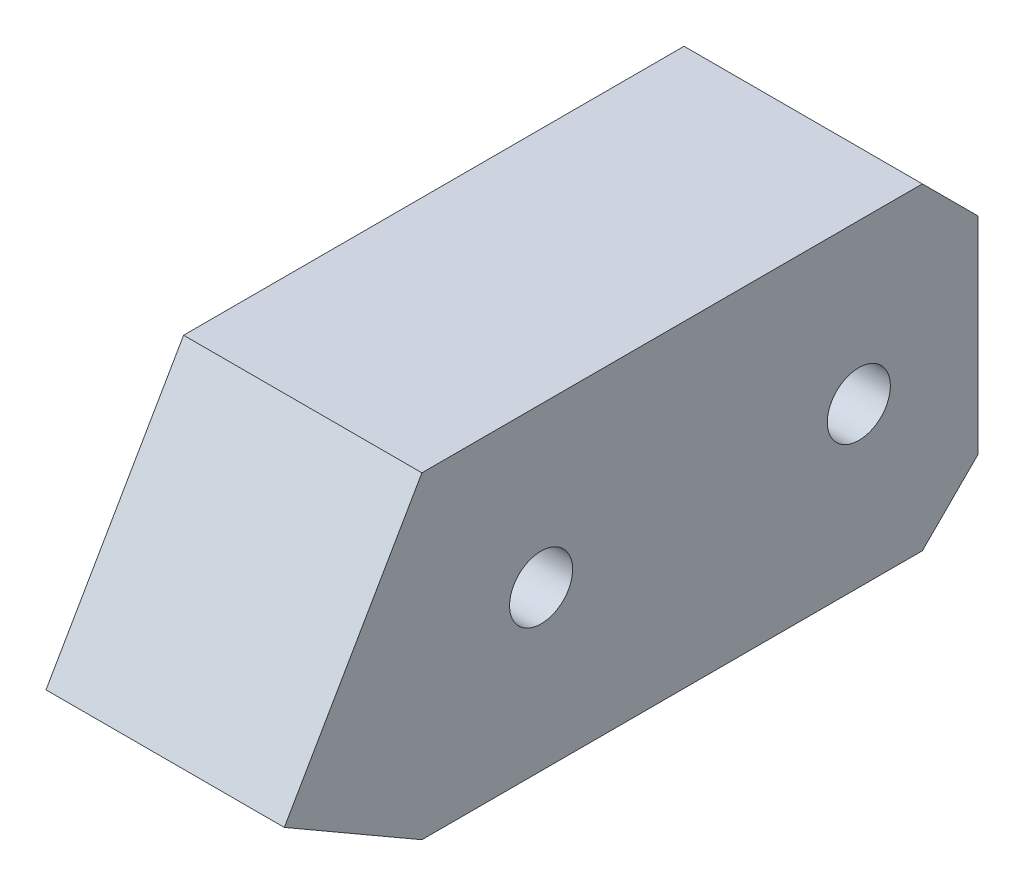
ISO-10303-21;
HEADER;
FILE_DESCRIPTION(('STEP AP214'),'2;1');
FILE_NAME('part.step','',(''),(''),'','','');
FILE_SCHEMA(('AUTOMOTIVE_DESIGN { 1 0 10303 214 1 1 1 1 }'));
ENDSEC;
DATA;
#1=APPLICATION_CONTEXT('core data for automotive mechanical design processes');
#2=APPLICATION_PROTOCOL_DEFINITION('international standard','automotive_design',2000,#1);
#3=PRODUCT_CONTEXT('',#1,'mechanical');
#4=PRODUCT('Part','Part','',(#3));
#5=PRODUCT_RELATED_PRODUCT_CATEGORY('part','',(#4));
#6=PRODUCT_DEFINITION_FORMATION('','',#4);
#7=PRODUCT_DEFINITION_CONTEXT('part definition',#1,'design');
#8=PRODUCT_DEFINITION('design','',#6,#7);
#9=PRODUCT_DEFINITION_SHAPE('','',#8);
#10=(LENGTH_UNIT() NAMED_UNIT(*) SI_UNIT(.MILLI.,.METRE.));
#11=(NAMED_UNIT(*) PLANE_ANGLE_UNIT() SI_UNIT($,.RADIAN.));
#12=(NAMED_UNIT(*) SI_UNIT($,.STERADIAN.) SOLID_ANGLE_UNIT());
#13=UNCERTAINTY_MEASURE_WITH_UNIT(LENGTH_MEASURE(1.E-05),#10,'distance_accuracy_value','');
#14=(GEOMETRIC_REPRESENTATION_CONTEXT(3) GLOBAL_UNCERTAINTY_ASSIGNED_CONTEXT((#13)) GLOBAL_UNIT_ASSIGNED_CONTEXT((#10,
#11,#12)) REPRESENTATION_CONTEXT('',''));
#15=CARTESIAN_POINT('',(0.,0.,0.));
#16=DIRECTION('',(0.,0.,1.));
#17=DIRECTION('',(1.,0.,0.));
#18=AXIS2_PLACEMENT_3D('',#15,#16,#17);
#19=CARTESIAN_POINT('',(15.,0.,0.));
#20=DIRECTION('',(-1.,0.,0.));
#21=DIRECTION('',(0.,0.,1.));
#22=AXIS2_PLACEMENT_3D('',#19,#20,#21);
#23=PLANE('',#22);
#24=DIRECTION('',(0.,0.,-1.));
#25=VECTOR('',#24,1.);
#26=CARTESIAN_POINT('',(15.,-20.,-35.));
#27=LINE('',#26,#25);
#28=CARTESIAN_POINT('',(15.,-20.,35.));
#29=VERTEX_POINT('',#28);
#30=CARTESIAN_POINT('',(15.,-20.,-28.));
#31=VERTEX_POINT('',#30);
#32=EDGE_CURVE('E142',#29,#31,#27,.T.);
#33=ORIENTED_EDGE('',*,*,#32,.T.);
#34=DIRECTION('',(0.,-0.707106781186546,0.707106781186549));
#35=VECTOR('',#34,1.);
#36=CARTESIAN_POINT('',(15.,-13.,-35.));
#37=LINE('',#36,#35);
#38=CARTESIAN_POINT('',(15.,-13.,-35.));
#39=VERTEX_POINT('',#38);
#40=EDGE_CURVE('E46',#31,#39,#37,.F.);
#41=ORIENTED_EDGE('',*,*,#40,.T.);
#42=DIRECTION('',(0.,1.,0.));
#43=VECTOR('',#42,1.);
#44=CARTESIAN_POINT('',(15.,20.,-35.));
#45=LINE('',#44,#43);
#46=CARTESIAN_POINT('',(15.,13.,-35.));
#47=VERTEX_POINT('',#46);
#48=EDGE_CURVE('E140',#39,#47,#45,.T.);
#49=ORIENTED_EDGE('',*,*,#48,.T.);
#50=DIRECTION('',(0.,-0.707106781186549,-0.707106781186546));
#51=VECTOR('',#50,1.);
#52=CARTESIAN_POINT('',(15.,20.,-28.));
#53=LINE('',#52,#51);
#54=CARTESIAN_POINT('',(15.,20.,-28.));
#55=VERTEX_POINT('',#54);
#56=EDGE_CURVE('E53',#47,#55,#53,.F.);
#57=ORIENTED_EDGE('',*,*,#56,.T.);
#58=DIRECTION('',(0.,0.,1.));
#59=VECTOR('',#58,1.);
#60=CARTESIAN_POINT('',(15.,20.,-35.));
#61=LINE('',#60,#59);
#62=CARTESIAN_POINT('',(15.,20.,35.));
#63=VERTEX_POINT('',#62);
#64=EDGE_CURVE('E150',#55,#63,#61,.T.);
#65=ORIENTED_EDGE('',*,*,#64,.T.);
#66=DIRECTION('',(0.,-0.866025403784441,0.499999999999995));
#67=VECTOR('',#66,1.);
#68=CARTESIAN_POINT('',(15.,20.,35.));
#69=LINE('',#68,#67);
#70=CARTESIAN_POINT('',(15.,-10.,52.3205080756886));
#71=VERTEX_POINT('',#70);
#72=EDGE_CURVE('E179',#63,#71,#69,.T.);
#73=ORIENTED_EDGE('',*,*,#72,.T.);
#74=DIRECTION('',(0.,-0.500000000000004,-0.866025403784436));
#75=VECTOR('',#74,1.);
#76=CARTESIAN_POINT('',(15.,-10.,52.3205080756886));
#77=LINE('',#76,#75);
#78=EDGE_CURVE('E174',#71,#29,#77,.T.);
#79=ORIENTED_EDGE('',*,*,#78,.T.);
#80=EDGE_LOOP('',(#33,#41,#49,#57,#65,#73,#79));
#81=FACE_BOUND('',#80,.T.);
#82=CARTESIAN_POINT('',(15.,0.,20.));
#83=DIRECTION('',(1.,0.,0.));
#84=DIRECTION('',(0.,0.,-1.));
#85=AXIS2_PLACEMENT_3D('',#82,#83,#84);
#86=CIRCLE('',#85,3.97);
#87=CARTESIAN_POINT('',(15.,0.,16.03));
#88=VERTEX_POINT('',#87);
#89=EDGE_CURVE('E167',#88,#88,#86,.T.);
#90=ORIENTED_EDGE('',*,*,#89,.F.);
#91=EDGE_LOOP('',(#90));
#92=FACE_BOUND('',#91,.T.);
#93=CARTESIAN_POINT('',(15.,0.,-20.));
#94=DIRECTION('',(1.,0.,0.));
#95=DIRECTION('',(0.,0.,-1.));
#96=AXIS2_PLACEMENT_3D('',#93,#94,#95);
#97=CIRCLE('',#96,3.97);
#98=CARTESIAN_POINT('',(15.,0.,-23.97));
#99=VERTEX_POINT('',#98);
#100=EDGE_CURVE('E251',#99,#99,#97,.T.);
#101=ORIENTED_EDGE('',*,*,#100,.F.);
#102=EDGE_LOOP('',(#101));
#103=FACE_BOUND('',#102,.T.);
#104=ADVANCED_FACE('F38',(#81,#92,#103),#23,.F.);
#105=CARTESIAN_POINT('',(-15.,0.,0.));
#106=DIRECTION('',(-1.,0.,0.));
#107=DIRECTION('',(0.,0.,1.));
#108=AXIS2_PLACEMENT_3D('',#105,#106,#107);
#109=PLANE('',#108);
#110=CARTESIAN_POINT('',(-15.,0.,20.));
#111=DIRECTION('',(1.,0.,0.));
#112=DIRECTION('',(0.,0.,-1.));
#113=AXIS2_PLACEMENT_3D('',#110,#111,#112);
#114=CIRCLE('',#113,3.97);
#115=CARTESIAN_POINT('',(-15.,0.,16.03));
#116=VERTEX_POINT('',#115);
#117=EDGE_CURVE('E195',#116,#116,#114,.T.);
#118=ORIENTED_EDGE('',*,*,#117,.T.);
#119=EDGE_LOOP('',(#118));
#120=FACE_BOUND('',#119,.T.);
#121=DIRECTION('',(0.,1.,0.));
#122=VECTOR('',#121,1.);
#123=CARTESIAN_POINT('',(-15.,20.,-35.));
#124=LINE('',#123,#122);
#125=CARTESIAN_POINT('',(-15.,-13.,-35.));
#126=VERTEX_POINT('',#125);
#127=CARTESIAN_POINT('',(-15.,13.,-35.));
#128=VERTEX_POINT('',#127);
#129=EDGE_CURVE('E159',#126,#128,#124,.T.);
#130=ORIENTED_EDGE('',*,*,#129,.F.);
#131=DIRECTION('',(0.,0.707106781186546,-0.707106781186549));
#132=VECTOR('',#131,1.);
#133=CARTESIAN_POINT('',(-15.,-24.,-23.9999999999999));
#134=LINE('',#133,#132);
#135=CARTESIAN_POINT('',(-15.,-20.,-28.));
#136=VERTEX_POINT('',#135);
#137=EDGE_CURVE('E134',#126,#136,#134,.F.);
#138=ORIENTED_EDGE('',*,*,#137,.T.);
#139=DIRECTION('',(0.,0.,-1.));
#140=VECTOR('',#139,1.);
#141=CARTESIAN_POINT('',(-15.,-20.,-35.));
#142=LINE('',#141,#140);
#143=CARTESIAN_POINT('',(-15.,-20.,35.));
#144=VERTEX_POINT('',#143);
#145=EDGE_CURVE('E157',#144,#136,#142,.T.);
#146=ORIENTED_EDGE('',*,*,#145,.F.);
#147=DIRECTION('',(0.,-0.500000000000004,-0.866025403784436));
#148=VECTOR('',#147,1.);
#149=CARTESIAN_POINT('',(-15.,-10.,52.3205080756886));
#150=LINE('',#149,#148);
#151=CARTESIAN_POINT('',(-15.,-10.,52.3205080756886));
#152=VERTEX_POINT('',#151);
#153=EDGE_CURVE('E163',#152,#144,#150,.T.);
#154=ORIENTED_EDGE('',*,*,#153,.F.);
#155=DIRECTION('',(0.,-0.866025403784441,0.499999999999995));
#156=VECTOR('',#155,1.);
#157=CARTESIAN_POINT('',(-15.,20.,35.));
#158=LINE('',#157,#156);
#159=CARTESIAN_POINT('',(-15.,20.,35.));
#160=VERTEX_POINT('',#159);
#161=EDGE_CURVE('E172',#160,#152,#158,.T.);
#162=ORIENTED_EDGE('',*,*,#161,.F.);
#163=DIRECTION('',(0.,0.,1.));
#164=VECTOR('',#163,1.);
#165=CARTESIAN_POINT('',(-15.,20.,-35.));
#166=LINE('',#165,#164);
#167=CARTESIAN_POINT('',(-15.,20.,-28.));
#168=VERTEX_POINT('',#167);
#169=EDGE_CURVE('E165',#168,#160,#166,.T.);
#170=ORIENTED_EDGE('',*,*,#169,.F.);
#171=DIRECTION('',(0.,0.707106781186549,0.707106781186546));
#172=VECTOR('',#171,1.);
#173=CARTESIAN_POINT('',(-15.,24.,-24.0000000000001));
#174=LINE('',#173,#172);
#175=EDGE_CURVE('E132',#168,#128,#174,.F.);
#176=ORIENTED_EDGE('',*,*,#175,.T.);
#177=EDGE_LOOP('',(#130,#138,#146,#154,#162,#170,#176));
#178=FACE_BOUND('',#177,.T.);
#179=CARTESIAN_POINT('',(-15.,0.,-20.));
#180=DIRECTION('',(1.,0.,0.));
#181=DIRECTION('',(0.,0.,-1.));
#182=AXIS2_PLACEMENT_3D('',#179,#180,#181);
#183=CIRCLE('',#182,3.97);
#184=CARTESIAN_POINT('',(-15.,0.,-23.97));
#185=VERTEX_POINT('',#184);
#186=EDGE_CURVE('E248',#185,#185,#183,.T.);
#187=ORIENTED_EDGE('',*,*,#186,.T.);
#188=EDGE_LOOP('',(#187));
#189=FACE_BOUND('',#188,.T.);
#190=ADVANCED_FACE('F154',(#120,#178,#189),#109,.T.);
#191=CARTESIAN_POINT('',(15.,-10.,52.3205080756886));
#192=DIRECTION('',(0.,0.866025403784436,-0.500000000000004));
#193=DIRECTION('',(0.,0.500000000000004,0.866025403784437));
#194=AXIS2_PLACEMENT_3D('',#191,#192,#193);
#195=PLANE('',#194);
#196=CARTESIAN_POINT('',(0.,-15.,43.6602540378443));
#197=DIRECTION('',(0.,-0.866025403784437,0.500000000000004));
#198=DIRECTION('',(0.,-0.500000000000004,-0.866025403784437));
#199=AXIS2_PLACEMENT_3D('',#196,#197,#198);
#200=CIRCLE('',#199,3.97);
#201=CARTESIAN_POINT('',(0.,-16.985,40.2221331848201));
#202=VERTEX_POINT('',#201);
#203=EDGE_CURVE('E237',#202,#202,#200,.T.);
#204=ORIENTED_EDGE('',*,*,#203,.F.);
#205=EDGE_LOOP('',(#204));
#206=FACE_BOUND('',#205,.T.);
#207=ORIENTED_EDGE('',*,*,#153,.T.);
#208=DIRECTION('',(-1.,0.,0.));
#209=VECTOR('',#208,1.);
#210=CARTESIAN_POINT('',(15.,-20.,35.));
#211=LINE('',#210,#209);
#212=EDGE_CURVE('E116',#29,#144,#211,.T.);
#213=ORIENTED_EDGE('',*,*,#212,.F.);
#214=ORIENTED_EDGE('',*,*,#78,.F.);
#215=DIRECTION('',(-1.,0.,0.));
#216=VECTOR('',#215,1.);
#217=CARTESIAN_POINT('',(15.,-10.,52.3205080756886));
#218=LINE('',#217,#216);
#219=EDGE_CURVE('E175',#71,#152,#218,.T.);
#220=ORIENTED_EDGE('',*,*,#219,.T.);
#221=EDGE_LOOP('',(#207,#213,#214,#220));
#222=FACE_BOUND('',#221,.T.);
#223=ADVANCED_FACE('F190',(#206,#222),#195,.F.);
#224=CARTESIAN_POINT('',(15.,-20.,-35.));
#225=DIRECTION('',(0.,1.,0.));
#226=DIRECTION('',(0.,0.,1.));
#227=AXIS2_PLACEMENT_3D('',#224,#225,#226);
#228=PLANE('',#227);
#229=CARTESIAN_POINT('',(0.,-20.,20.));
#230=DIRECTION('',(0.,-1.,0.));
#231=DIRECTION('',(0.,0.,-1.));
#232=AXIS2_PLACEMENT_3D('',#229,#230,#231);
#233=CIRCLE('',#232,3.97);
#234=CARTESIAN_POINT('',(0.,-20.,16.03));
#235=VERTEX_POINT('',#234);
#236=EDGE_CURVE('E245',#235,#235,#233,.T.);
#237=ORIENTED_EDGE('',*,*,#236,.F.);
#238=EDGE_LOOP('',(#237));
#239=FACE_BOUND('',#238,.T.);
#240=CARTESIAN_POINT('',(0.,-20.,-20.));
#241=DIRECTION('',(0.,-1.,0.));
#242=DIRECTION('',(0.,0.,-1.));
#243=AXIS2_PLACEMENT_3D('',#240,#241,#242);
#244=CIRCLE('',#243,3.97);
#245=CARTESIAN_POINT('',(0.,-20.,-23.97));
#246=VERTEX_POINT('',#245);
#247=EDGE_CURVE('E242',#246,#246,#244,.T.);
#248=ORIENTED_EDGE('',*,*,#247,.F.);
#249=EDGE_LOOP('',(#248));
#250=FACE_BOUND('',#249,.T.);
#251=ORIENTED_EDGE('',*,*,#145,.T.);
#252=DIRECTION('',(1.,0.,0.));
#253=VECTOR('',#252,1.);
#254=CARTESIAN_POINT('',(15.,-20.,-28.));
#255=LINE('',#254,#253);
#256=EDGE_CURVE('E61',#136,#31,#255,.T.);
#257=ORIENTED_EDGE('',*,*,#256,.T.);
#258=ORIENTED_EDGE('',*,*,#32,.F.);
#259=ORIENTED_EDGE('',*,*,#212,.T.);
#260=EDGE_LOOP('',(#251,#257,#258,#259));
#261=FACE_BOUND('',#260,.T.);
#262=ADVANCED_FACE('F160',(#239,#250,#261),#228,.F.);
#263=CARTESIAN_POINT('',(15.,20.,-35.));
#264=DIRECTION('',(0.,0.,1.));
#265=DIRECTION('',(0.,-1.,0.));
#266=AXIS2_PLACEMENT_3D('',#263,#264,#265);
#267=PLANE('',#266);
#268=ORIENTED_EDGE('',*,*,#48,.F.);
#269=DIRECTION('',(-1.,0.,0.));
#270=VECTOR('',#269,1.);
#271=CARTESIAN_POINT('',(15.,-13.,-35.));
#272=LINE('',#271,#270);
#273=EDGE_CURVE('E129',#39,#126,#272,.T.);
#274=ORIENTED_EDGE('',*,*,#273,.T.);
#275=ORIENTED_EDGE('',*,*,#129,.T.);
#276=DIRECTION('',(1.,0.,0.));
#277=VECTOR('',#276,1.);
#278=CARTESIAN_POINT('',(15.,13.,-35.));
#279=LINE('',#278,#277);
#280=EDGE_CURVE('E127',#128,#47,#279,.T.);
#281=ORIENTED_EDGE('',*,*,#280,.T.);
#282=EDGE_LOOP('',(#268,#274,#275,#281));
#283=FACE_BOUND('',#282,.T.);
#284=ADVANCED_FACE('F146',(#283),#267,.F.);
#285=CARTESIAN_POINT('',(15.,20.,-35.));
#286=DIRECTION('',(0.,-1.,0.));
#287=DIRECTION('',(0.,0.,-1.));
#288=AXIS2_PLACEMENT_3D('',#285,#286,#287);
#289=PLANE('',#288);
#290=ORIENTED_EDGE('',*,*,#64,.F.);
#291=DIRECTION('',(-1.,0.,0.));
#292=VECTOR('',#291,1.);
#293=CARTESIAN_POINT('',(15.,20.,-28.));
#294=LINE('',#293,#292);
#295=EDGE_CURVE('E11',#55,#168,#294,.T.);
#296=ORIENTED_EDGE('',*,*,#295,.T.);
#297=ORIENTED_EDGE('',*,*,#169,.T.);
#298=DIRECTION('',(-1.,0.,0.));
#299=VECTOR('',#298,1.);
#300=CARTESIAN_POINT('',(15.,20.,35.));
#301=LINE('',#300,#299);
#302=EDGE_CURVE('E178',#63,#160,#301,.T.);
#303=ORIENTED_EDGE('',*,*,#302,.F.);
#304=EDGE_LOOP('',(#290,#296,#297,#303));
#305=FACE_BOUND('',#304,.T.);
#306=ADVANCED_FACE('F199',(#305),#289,.F.);
#307=CARTESIAN_POINT('',(15.,20.,35.));
#308=DIRECTION('',(0.,-0.499999999999995,-0.866025403784441));
#309=DIRECTION('',(0.,0.866025403784441,-0.499999999999995));
#310=AXIS2_PLACEMENT_3D('',#307,#308,#309);
#311=PLANE('',#310);
#312=ORIENTED_EDGE('',*,*,#161,.T.);
#313=ORIENTED_EDGE('',*,*,#219,.F.);
#314=ORIENTED_EDGE('',*,*,#72,.F.);
#315=ORIENTED_EDGE('',*,*,#302,.T.);
#316=EDGE_LOOP('',(#312,#313,#314,#315));
#317=FACE_BOUND('',#316,.T.);
#318=ADVANCED_FACE('F185',(#317),#311,.F.);
#319=CARTESIAN_POINT('',(15.,0.,20.));
#320=DIRECTION('',(-1.,0.,0.));
#321=DIRECTION('',(0.,0.,1.));
#322=AXIS2_PLACEMENT_3D('',#319,#320,#321);
#323=CYLINDRICAL_SURFACE('',#322,3.97);
#324=CARTESIAN_POINT('',(0.,0.,20.));
#325=DIRECTION('',(-0.707106781186547,-0.707106781186547,0.));
#326=DIRECTION('',(-0.707106781186547,0.707106781186547,0.));
#327=AXIS2_PLACEMENT_3D('',#324,#325,#326);
#328=ELLIPSE('',#327,5.61442784262119,3.97);
#329=CARTESIAN_POINT('',(0.,0.,23.97));
#330=VERTEX_POINT('',#329);
#331=CARTESIAN_POINT('',(0.,0.,16.03));
#332=VERTEX_POINT('',#331);
#333=EDGE_CURVE('E122',#330,#332,#328,.F.);
#334=ORIENTED_EDGE('',*,*,#333,.F.);
#335=CARTESIAN_POINT('',(0.,0.,20.));
#336=DIRECTION('',(-0.707106781186547,0.707106781186547,0.));
#337=DIRECTION('',(-0.707106781186547,-0.707106781186547,0.));
#338=AXIS2_PLACEMENT_3D('',#335,#336,#337);
#339=ELLIPSE('',#338,5.61442784262119,3.97);
#340=EDGE_CURVE('E120',#332,#330,#339,.T.);
#341=ORIENTED_EDGE('',*,*,#340,.F.);
#342=EDGE_LOOP('',(#334,#341));
#343=FACE_BOUND('',#342,.T.);
#344=ORIENTED_EDGE('',*,*,#89,.T.);
#345=EDGE_LOOP('',(#344));
#346=FACE_BOUND('',#345,.T.);
#347=ORIENTED_EDGE('',*,*,#117,.F.);
#348=EDGE_LOOP('',(#347));
#349=FACE_BOUND('',#348,.T.);
#350=ADVANCED_FACE('F219',(#343,#346,#349),#323,.F.);
#351=CARTESIAN_POINT('',(15.,0.,-20.));
#352=DIRECTION('',(-1.,0.,0.));
#353=DIRECTION('',(0.,0.,1.));
#354=AXIS2_PLACEMENT_3D('',#351,#352,#353);
#355=CYLINDRICAL_SURFACE('',#354,3.97);
#356=CARTESIAN_POINT('',(0.,0.,-20.));
#357=DIRECTION('',(-0.707106781186547,-0.707106781186547,0.));
#358=DIRECTION('',(-0.707106781186547,0.707106781186547,0.));
#359=AXIS2_PLACEMENT_3D('',#356,#357,#358);
#360=ELLIPSE('',#359,5.61442784262119,3.97);
#361=CARTESIAN_POINT('',(0.,0.,-16.03));
#362=VERTEX_POINT('',#361);
#363=CARTESIAN_POINT('',(0.,0.,-23.97));
#364=VERTEX_POINT('',#363);
#365=EDGE_CURVE('E114',#362,#364,#360,.F.);
#366=ORIENTED_EDGE('',*,*,#365,.F.);
#367=CARTESIAN_POINT('',(0.,0.,-20.));
#368=DIRECTION('',(-0.707106781186547,0.707106781186547,0.));
#369=DIRECTION('',(-0.707106781186547,-0.707106781186547,0.));
#370=AXIS2_PLACEMENT_3D('',#367,#368,#369);
#371=ELLIPSE('',#370,5.61442784262119,3.97);
#372=EDGE_CURVE('E110',#364,#362,#371,.T.);
#373=ORIENTED_EDGE('',*,*,#372,.F.);
#374=EDGE_LOOP('',(#366,#373));
#375=FACE_BOUND('',#374,.T.);
#376=ORIENTED_EDGE('',*,*,#100,.T.);
#377=EDGE_LOOP('',(#376));
#378=FACE_BOUND('',#377,.T.);
#379=ORIENTED_EDGE('',*,*,#186,.F.);
#380=EDGE_LOOP('',(#379));
#381=FACE_BOUND('',#380,.T.);
#382=ADVANCED_FACE('F118',(#375,#378,#381),#355,.F.);
#383=CARTESIAN_POINT('',(0.,0.,-20.));
#384=DIRECTION('',(0.,-1.,0.));
#385=DIRECTION('',(0.,0.,-1.));
#386=AXIS2_PLACEMENT_3D('',#383,#384,#385);
#387=CYLINDRICAL_SURFACE('',#386,3.97);
#388=ORIENTED_EDGE('',*,*,#365,.T.);
#389=ORIENTED_EDGE('',*,*,#372,.T.);
#390=EDGE_LOOP('',(#388,#389));
#391=FACE_BOUND('',#390,.T.);
#392=ORIENTED_EDGE('',*,*,#247,.T.);
#393=EDGE_LOOP('',(#392));
#394=FACE_BOUND('',#393,.T.);
#395=ADVANCED_FACE('F112',(#391,#394),#387,.F.);
#396=CARTESIAN_POINT('',(0.,0.,20.));
#397=DIRECTION('',(0.,-1.,0.));
#398=DIRECTION('',(0.,0.,-1.));
#399=AXIS2_PLACEMENT_3D('',#396,#397,#398);
#400=CYLINDRICAL_SURFACE('',#399,3.97);
#401=ORIENTED_EDGE('',*,*,#333,.T.);
#402=ORIENTED_EDGE('',*,*,#340,.T.);
#403=EDGE_LOOP('',(#401,#402));
#404=FACE_BOUND('',#403,.T.);
#405=ORIENTED_EDGE('',*,*,#236,.T.);
#406=EDGE_LOOP('',(#405));
#407=FACE_BOUND('',#406,.T.);
#408=ADVANCED_FACE('F210',(#404,#407),#400,.F.);
#409=CARTESIAN_POINT('',(15.,-13.,-35.));
#410=DIRECTION('',(0.,0.707106781186549,0.707106781186546));
#411=DIRECTION('',(-1.,0.,0.));
#412=AXIS2_PLACEMENT_3D('',#409,#410,#411);
#413=PLANE('',#412);
#414=ORIENTED_EDGE('',*,*,#40,.F.);
#415=ORIENTED_EDGE('',*,*,#256,.F.);
#416=ORIENTED_EDGE('',*,*,#137,.F.);
#417=ORIENTED_EDGE('',*,*,#273,.F.);
#418=EDGE_LOOP('',(#414,#415,#416,#417));
#419=FACE_BOUND('',#418,.T.);
#420=ADVANCED_FACE('F152',(#419),#413,.F.);
#421=CARTESIAN_POINT('',(15.,20.,-28.));
#422=DIRECTION('',(0.,-0.707106781186546,0.707106781186549));
#423=DIRECTION('',(-1.,0.,0.));
#424=AXIS2_PLACEMENT_3D('',#421,#422,#423);
#425=PLANE('',#424);
#426=ORIENTED_EDGE('',*,*,#56,.F.);
#427=ORIENTED_EDGE('',*,*,#280,.F.);
#428=ORIENTED_EDGE('',*,*,#175,.F.);
#429=ORIENTED_EDGE('',*,*,#295,.F.);
#430=EDGE_LOOP('',(#426,#427,#428,#429));
#431=FACE_BOUND('',#430,.T.);
#432=ADVANCED_FACE('F40',(#431),#425,.F.);
#433=CARTESIAN_POINT('',(0.,2.3205080756887,33.6602540378442));
#434=DIRECTION('',(0.,-0.866025403784437,0.500000000000004));
#435=DIRECTION('',(0.,-0.500000000000004,-0.866025403784437));
#436=AXIS2_PLACEMENT_3D('',#433,#434,#435);
#437=CYLINDRICAL_SURFACE('',#436,3.97);
#438=CARTESIAN_POINT('',(0.,2.3205080756887,33.6602540378442));
#439=DIRECTION('',(0.,-0.866025403784437,0.500000000000004));
#440=DIRECTION('',(0.,-0.500000000000004,-0.866025403784437));
#441=AXIS2_PLACEMENT_3D('',#438,#439,#440);
#442=CIRCLE('',#441,3.97);
#443=CARTESIAN_POINT('',(0.,0.335508075688689,30.22213318482));
#444=VERTEX_POINT('',#443);
#445=EDGE_CURVE('E239',#444,#444,#442,.T.);
#446=ORIENTED_EDGE('',*,*,#445,.F.);
#447=EDGE_LOOP('',(#446));
#448=FACE_BOUND('',#447,.T.);
#449=ORIENTED_EDGE('',*,*,#203,.T.);
#450=EDGE_LOOP('',(#449));
#451=FACE_BOUND('',#450,.T.);
#452=ADVANCED_FACE('F202',(#448,#451),#437,.F.);
#453=CARTESIAN_POINT('',(0.,2.3205080756887,33.6602540378442));
#454=DIRECTION('',(0.,-0.866025403784437,0.500000000000004));
#455=DIRECTION('',(0.,-0.500000000000004,-0.866025403784437));
#456=AXIS2_PLACEMENT_3D('',#453,#454,#455);
#457=PLANE('',#456);
#458=ORIENTED_EDGE('',*,*,#445,.T.);
#459=EDGE_LOOP('',(#458));
#460=FACE_BOUND('',#459,.T.);
#461=ADVANCED_FACE('F207',(#460),#457,.T.);
#462=CLOSED_SHELL('',(#104,#190,#223,#262,#284,#306,#318,#350,#382,#395,#408,#420,#432,#452,#461));
#463=MANIFOLD_SOLID_BREP('B2',#462);
#464=ADVANCED_BREP_SHAPE_REPRESENTATION('',(#18,#463),#14);
#465=SHAPE_DEFINITION_REPRESENTATION(#9,#464);
ENDSEC;
END-ISO-10303-21;
